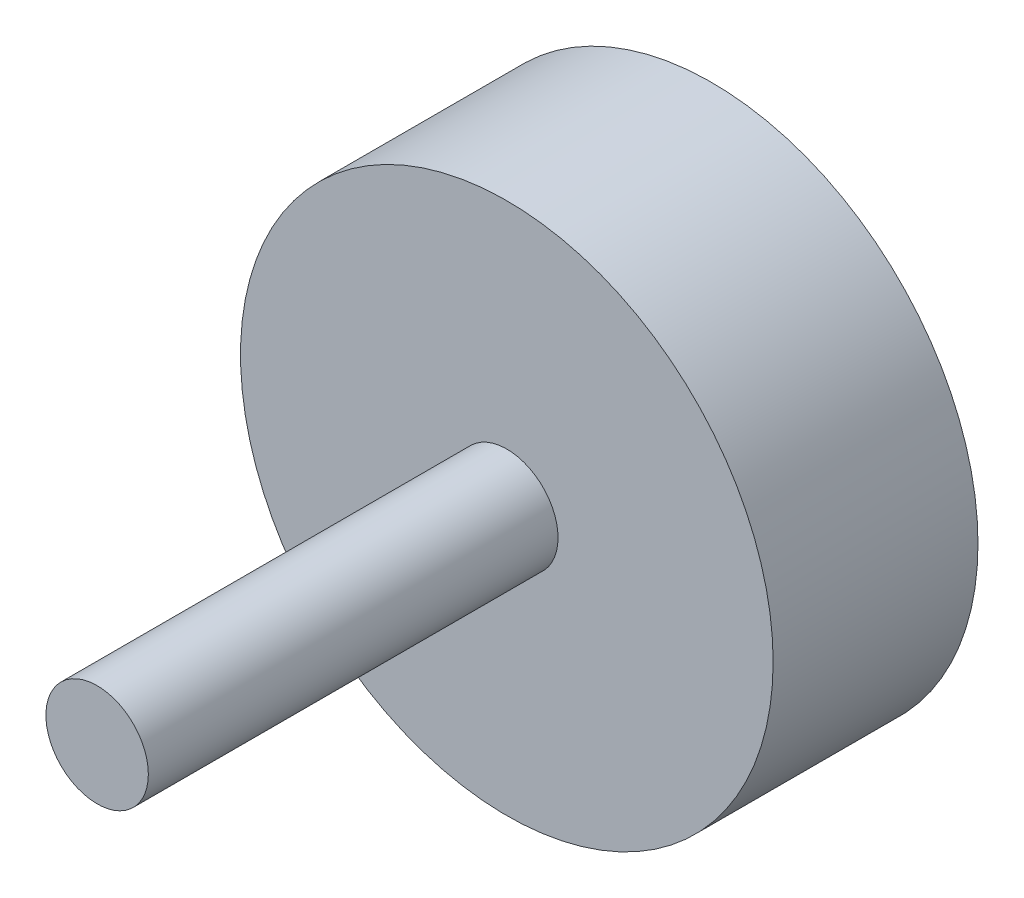
ISO-10303-21;
HEADER;
FILE_DESCRIPTION(('STEP AP214'),'2;1');
FILE_NAME('part.step','',(''),(''),'','','');
FILE_SCHEMA(('AUTOMOTIVE_DESIGN { 1 0 10303 214 1 1 1 1 }'));
ENDSEC;
DATA;
#1=APPLICATION_CONTEXT('core data for automotive mechanical design processes');
#2=APPLICATION_PROTOCOL_DEFINITION('international standard','automotive_design',2000,#1);
#3=PRODUCT_CONTEXT('',#1,'mechanical');
#4=PRODUCT('Part','Part','',(#3));
#5=PRODUCT_RELATED_PRODUCT_CATEGORY('part','',(#4));
#6=PRODUCT_DEFINITION_FORMATION('','',#4);
#7=PRODUCT_DEFINITION_CONTEXT('part definition',#1,'design');
#8=PRODUCT_DEFINITION('design','',#6,#7);
#9=PRODUCT_DEFINITION_SHAPE('','',#8);
#10=(LENGTH_UNIT() NAMED_UNIT(*) SI_UNIT(.MILLI.,.METRE.));
#11=(NAMED_UNIT(*) PLANE_ANGLE_UNIT() SI_UNIT($,.RADIAN.));
#12=(NAMED_UNIT(*) SI_UNIT($,.STERADIAN.) SOLID_ANGLE_UNIT());
#13=UNCERTAINTY_MEASURE_WITH_UNIT(LENGTH_MEASURE(1.E-05),#10,'distance_accuracy_value','');
#14=(GEOMETRIC_REPRESENTATION_CONTEXT(3) GLOBAL_UNCERTAINTY_ASSIGNED_CONTEXT((#13)) GLOBAL_UNIT_ASSIGNED_CONTEXT((#10,
#11,#12)) REPRESENTATION_CONTEXT('',''));
#15=CARTESIAN_POINT('',(0.,0.,0.));
#16=DIRECTION('',(0.,0.,1.));
#17=DIRECTION('',(1.,0.,0.));
#18=AXIS2_PLACEMENT_3D('',#15,#16,#17);
#19=CARTESIAN_POINT('',(0.,0.,20.));
#20=DIRECTION('',(0.,0.,-1.));
#21=DIRECTION('',(-1.,0.,0.));
#22=AXIS2_PLACEMENT_3D('',#19,#20,#21);
#23=CYLINDRICAL_SURFACE('',#22,26.);
#24=CARTESIAN_POINT('',(0.,0.,20.));
#25=DIRECTION('',(0.,0.,1.));
#26=DIRECTION('',(1.,0.,0.));
#27=AXIS2_PLACEMENT_3D('',#24,#25,#26);
#28=CIRCLE('',#27,26.);
#29=CARTESIAN_POINT('',(26.,0.,20.));
#30=VERTEX_POINT('',#29);
#31=EDGE_CURVE('E12',#30,#30,#28,.T.);
#32=ORIENTED_EDGE('',*,*,#31,.F.);
#33=EDGE_LOOP('',(#32));
#34=FACE_BOUND('',#33,.T.);
#35=CARTESIAN_POINT('',(0.,0.,0.));
#36=DIRECTION('',(0.,0.,1.));
#37=DIRECTION('',(1.,0.,0.));
#38=AXIS2_PLACEMENT_3D('',#35,#36,#37);
#39=CIRCLE('',#38,26.);
#40=CARTESIAN_POINT('',(26.,0.,0.));
#41=VERTEX_POINT('',#40);
#42=EDGE_CURVE('E49',#41,#41,#39,.T.);
#43=ORIENTED_EDGE('',*,*,#42,.T.);
#44=EDGE_LOOP('',(#43));
#45=FACE_BOUND('',#44,.T.);
#46=ADVANCED_FACE('F46',(#34,#45),#23,.T.);
#47=CARTESIAN_POINT('',(0.,0.,20.));
#48=DIRECTION('',(0.,0.,1.));
#49=DIRECTION('',(1.,0.,0.));
#50=AXIS2_PLACEMENT_3D('',#47,#48,#49);
#51=PLANE('',#50);
#52=CARTESIAN_POINT('',(0.,0.,20.));
#53=DIRECTION('',(0.,0.,1.));
#54=DIRECTION('',(1.,0.,0.));
#55=AXIS2_PLACEMENT_3D('',#52,#53,#54);
#56=CIRCLE('',#55,5.);
#57=CARTESIAN_POINT('',(5.,0.,20.));
#58=VERTEX_POINT('',#57);
#59=EDGE_CURVE('E58',#58,#58,#56,.T.);
#60=ORIENTED_EDGE('',*,*,#59,.F.);
#61=EDGE_LOOP('',(#60));
#62=FACE_BOUND('',#61,.T.);
#63=ORIENTED_EDGE('',*,*,#31,.T.);
#64=EDGE_LOOP('',(#63));
#65=FACE_BOUND('',#64,.T.);
#66=ADVANCED_FACE('F73',(#62,#65),#51,.T.);
#67=CARTESIAN_POINT('',(0.,0.,0.));
#68=DIRECTION('',(0.,0.,1.));
#69=DIRECTION('',(1.,0.,0.));
#70=AXIS2_PLACEMENT_3D('',#67,#68,#69);
#71=PLANE('',#70);
#72=ORIENTED_EDGE('',*,*,#42,.F.);
#73=EDGE_LOOP('',(#72));
#74=FACE_BOUND('',#73,.T.);
#75=ADVANCED_FACE('F69',(#74),#71,.F.);
#76=CARTESIAN_POINT('',(0.,0.,60.));
#77=DIRECTION('',(0.,0.,-1.));
#78=DIRECTION('',(-1.,0.,0.));
#79=AXIS2_PLACEMENT_3D('',#76,#77,#78);
#80=CYLINDRICAL_SURFACE('',#79,5.);
#81=CARTESIAN_POINT('',(0.,0.,60.));
#82=DIRECTION('',(0.,0.,1.));
#83=DIRECTION('',(1.,0.,0.));
#84=AXIS2_PLACEMENT_3D('',#81,#82,#83);
#85=CIRCLE('',#84,5.);
#86=CARTESIAN_POINT('',(5.,0.,60.));
#87=VERTEX_POINT('',#86);
#88=EDGE_CURVE('E56',#87,#87,#85,.T.);
#89=ORIENTED_EDGE('',*,*,#88,.F.);
#90=EDGE_LOOP('',(#89));
#91=FACE_BOUND('',#90,.T.);
#92=ORIENTED_EDGE('',*,*,#59,.T.);
#93=EDGE_LOOP('',(#92));
#94=FACE_BOUND('',#93,.T.);
#95=ADVANCED_FACE('F66',(#91,#94),#80,.T.);
#96=CARTESIAN_POINT('',(0.,0.,60.));
#97=DIRECTION('',(0.,0.,1.));
#98=DIRECTION('',(1.,0.,0.));
#99=AXIS2_PLACEMENT_3D('',#96,#97,#98);
#100=PLANE('',#99);
#101=ORIENTED_EDGE('',*,*,#88,.T.);
#102=EDGE_LOOP('',(#101));
#103=FACE_BOUND('',#102,.T.);
#104=ADVANCED_FACE('F64',(#103),#100,.T.);
#105=CLOSED_SHELL('',(#46,#66,#75,#95,#104));
#106=MANIFOLD_SOLID_BREP('B2',#105);
#107=ADVANCED_BREP_SHAPE_REPRESENTATION('',(#18,#106),#14);
#108=SHAPE_DEFINITION_REPRESENTATION(#9,#107);
ENDSEC;
END-ISO-10303-21;
